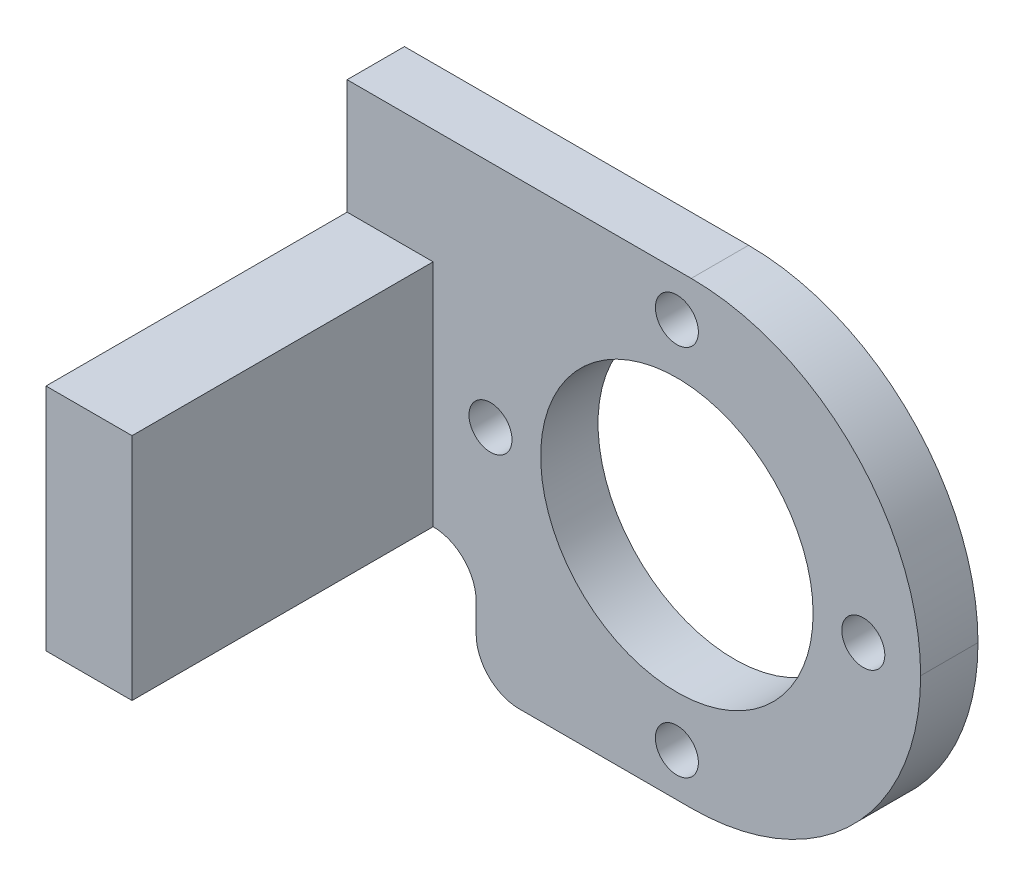
ISO-10303-21;
HEADER;
FILE_DESCRIPTION(('STEP AP214'),'2;1');
FILE_NAME('part.step','',(''),(''),'','','');
FILE_SCHEMA(('AUTOMOTIVE_DESIGN { 1 0 10303 214 1 1 1 1 }'));
ENDSEC;
DATA;
#1=APPLICATION_CONTEXT('core data for automotive mechanical design processes');
#2=APPLICATION_PROTOCOL_DEFINITION('international standard','automotive_design',2000,#1);
#3=PRODUCT_CONTEXT('',#1,'mechanical');
#4=PRODUCT('Part','Part','',(#3));
#5=PRODUCT_RELATED_PRODUCT_CATEGORY('part','',(#4));
#6=PRODUCT_DEFINITION_FORMATION('','',#4);
#7=PRODUCT_DEFINITION_CONTEXT('part definition',#1,'design');
#8=PRODUCT_DEFINITION('design','',#6,#7);
#9=PRODUCT_DEFINITION_SHAPE('','',#8);
#10=(LENGTH_UNIT() NAMED_UNIT(*) SI_UNIT(.MILLI.,.METRE.));
#11=(NAMED_UNIT(*) PLANE_ANGLE_UNIT() SI_UNIT($,.RADIAN.));
#12=(NAMED_UNIT(*) SI_UNIT($,.STERADIAN.) SOLID_ANGLE_UNIT());
#13=UNCERTAINTY_MEASURE_WITH_UNIT(LENGTH_MEASURE(1.E-05),#10,'distance_accuracy_value','');
#14=(GEOMETRIC_REPRESENTATION_CONTEXT(3) GLOBAL_UNCERTAINTY_ASSIGNED_CONTEXT((#13)) GLOBAL_UNIT_ASSIGNED_CONTEXT((#10,
#11,#12)) REPRESENTATION_CONTEXT('',''));
#15=CARTESIAN_POINT('',(0.,0.,0.));
#16=DIRECTION('',(0.,0.,1.));
#17=DIRECTION('',(1.,0.,0.));
#18=AXIS2_PLACEMENT_3D('',#15,#16,#17);
#19=CARTESIAN_POINT('',(-17.,16.,21.));
#20=DIRECTION('',(-1.,0.,0.));
#21=DIRECTION('',(0.,0.,1.));
#22=AXIS2_PLACEMENT_3D('',#19,#20,#21);
#23=PLANE('',#22);
#24=DIRECTION('',(0.,-1.,0.));
#25=VECTOR('',#24,1.);
#26=CARTESIAN_POINT('',(-17.,16.,21.));
#27=LINE('',#26,#25);
#28=CARTESIAN_POINT('',(-17.,8.,21.));
#29=VERTEX_POINT('',#28);
#30=CARTESIAN_POINT('',(-17.,-8.,21.));
#31=VERTEX_POINT('',#30);
#32=EDGE_CURVE('E149',#29,#31,#27,.T.);
#33=ORIENTED_EDGE('',*,*,#32,.T.);
#34=DIRECTION('',(0.,0.,1.));
#35=VECTOR('',#34,1.);
#36=CARTESIAN_POINT('',(-17.,-8.,21.));
#37=LINE('',#36,#35);
#38=CARTESIAN_POINT('',(-17.,-8.,0.));
#39=VERTEX_POINT('',#38);
#40=EDGE_CURVE('E137',#39,#31,#37,.T.);
#41=ORIENTED_EDGE('',*,*,#40,.F.);
#42=DIRECTION('',(0.,-1.,0.));
#43=VECTOR('',#42,1.);
#44=CARTESIAN_POINT('',(-17.,16.,0.));
#45=LINE('',#44,#43);
#46=CARTESIAN_POINT('',(-17.,8.,0.));
#47=VERTEX_POINT('',#46);
#48=EDGE_CURVE('E143',#47,#39,#45,.T.);
#49=ORIENTED_EDGE('',*,*,#48,.F.);
#50=DIRECTION('',(0.,0.,-1.));
#51=VECTOR('',#50,1.);
#52=CARTESIAN_POINT('',(-17.,8.,21.));
#53=LINE('',#52,#51);
#54=EDGE_CURVE('E206',#29,#47,#53,.T.);
#55=ORIENTED_EDGE('',*,*,#54,.F.);
#56=EDGE_LOOP('',(#33,#41,#49,#55));
#57=FACE_BOUND('',#56,.T.);
#58=ADVANCED_FACE('F31',(#57),#23,.F.);
#59=CARTESIAN_POINT('',(-17.,16.,0.));
#60=DIRECTION('',(0.,0.,-1.));
#61=DIRECTION('',(-1.,0.,0.));
#62=AXIS2_PLACEMENT_3D('',#59,#60,#61);
#63=PLANE('',#62);
#64=CARTESIAN_POINT('',(0.,13.,0.));
#65=DIRECTION('',(0.,0.,-1.));
#66=DIRECTION('',(-1.,0.,0.));
#67=AXIS2_PLACEMENT_3D('',#64,#65,#66);
#68=CIRCLE('',#67,1.5);
#69=CARTESIAN_POINT('',(-1.5,13.,0.));
#70=VERTEX_POINT('',#69);
#71=EDGE_CURVE('E453',#70,#70,#68,.T.);
#72=ORIENTED_EDGE('',*,*,#71,.T.);
#73=EDGE_LOOP('',(#72));
#74=FACE_BOUND('',#73,.T.);
#75=CARTESIAN_POINT('',(-13.,0.,0.));
#76=DIRECTION('',(0.,0.,-1.));
#77=DIRECTION('',(-1.,0.,0.));
#78=AXIS2_PLACEMENT_3D('',#75,#76,#77);
#79=CIRCLE('',#78,1.5);
#80=CARTESIAN_POINT('',(-14.5,0.,0.));
#81=VERTEX_POINT('',#80);
#82=EDGE_CURVE('E449',#81,#81,#79,.T.);
#83=ORIENTED_EDGE('',*,*,#82,.T.);
#84=EDGE_LOOP('',(#83));
#85=FACE_BOUND('',#84,.T.);
#86=CARTESIAN_POINT('',(0.,-13.,0.));
#87=DIRECTION('',(0.,0.,-1.));
#88=DIRECTION('',(-1.,0.,0.));
#89=AXIS2_PLACEMENT_3D('',#86,#87,#88);
#90=CIRCLE('',#89,1.5);
#91=CARTESIAN_POINT('',(-1.5,-13.,0.));
#92=VERTEX_POINT('',#91);
#93=EDGE_CURVE('E445',#92,#92,#90,.T.);
#94=ORIENTED_EDGE('',*,*,#93,.T.);
#95=EDGE_LOOP('',(#94));
#96=FACE_BOUND('',#95,.T.);
#97=CARTESIAN_POINT('',(13.,0.,0.));
#98=DIRECTION('',(0.,0.,-1.));
#99=DIRECTION('',(-1.,0.,0.));
#100=AXIS2_PLACEMENT_3D('',#97,#98,#99);
#101=CIRCLE('',#100,1.5);
#102=CARTESIAN_POINT('',(11.5,0.,0.));
#103=VERTEX_POINT('',#102);
#104=EDGE_CURVE('E170',#103,#103,#101,.T.);
#105=ORIENTED_EDGE('',*,*,#104,.T.);
#106=EDGE_LOOP('',(#105));
#107=FACE_BOUND('',#106,.T.);
#108=CARTESIAN_POINT('',(0.,0.,0.));
#109=DIRECTION('',(0.,0.,1.));
#110=DIRECTION('',(1.,0.,0.));
#111=AXIS2_PLACEMENT_3D('',#108,#109,#110);
#112=CIRCLE('',#111,9.5);
#113=CARTESIAN_POINT('',(9.5,0.,0.));
#114=VERTEX_POINT('',#113);
#115=EDGE_CURVE('E169',#114,#114,#112,.T.);
#116=ORIENTED_EDGE('',*,*,#115,.F.);
#117=EDGE_LOOP('',(#116));
#118=FACE_BOUND('',#117,.T.);
#119=DIRECTION('',(0.,1.,0.));
#120=VECTOR('',#119,1.);
#121=CARTESIAN_POINT('',(-14.,-8.,0.));
#122=LINE('',#121,#120);
#123=CARTESIAN_POINT('',(-14.,-13.,0.));
#124=VERTEX_POINT('',#123);
#125=CARTESIAN_POINT('',(-14.,-11.,0.));
#126=VERTEX_POINT('',#125);
#127=EDGE_CURVE('E185',#124,#126,#122,.T.);
#128=ORIENTED_EDGE('',*,*,#127,.F.);
#129=CARTESIAN_POINT('',(-11.,-13.,0.));
#130=DIRECTION('',(0.,0.,-1.));
#131=DIRECTION('',(-1.,0.,0.));
#132=AXIS2_PLACEMENT_3D('',#129,#130,#131);
#133=CIRCLE('',#132,3.);
#134=CARTESIAN_POINT('',(-11.,-16.,0.));
#135=VERTEX_POINT('',#134);
#136=EDGE_CURVE('E175',#124,#135,#133,.F.);
#137=ORIENTED_EDGE('',*,*,#136,.T.);
#138=DIRECTION('',(1.,0.,0.));
#139=VECTOR('',#138,1.);
#140=CARTESIAN_POINT('',(-17.,-16.,0.));
#141=LINE('',#140,#139);
#142=CARTESIAN_POINT('',(1.,-16.,0.));
#143=VERTEX_POINT('',#142);
#144=EDGE_CURVE('E217',#135,#143,#141,.T.);
#145=ORIENTED_EDGE('',*,*,#144,.T.);
#146=CARTESIAN_POINT('',(1.,0.,0.));
#147=DIRECTION('',(0.,0.,-1.));
#148=DIRECTION('',(-1.,0.,0.));
#149=AXIS2_PLACEMENT_3D('',#146,#147,#148);
#150=CIRCLE('',#149,16.);
#151=CARTESIAN_POINT('',(17.,0.,0.));
#152=VERTEX_POINT('',#151);
#153=EDGE_CURVE('E161',#143,#152,#150,.F.);
#154=ORIENTED_EDGE('',*,*,#153,.T.);
#155=CARTESIAN_POINT('',(1.,0.,0.));
#156=DIRECTION('',(0.,0.,-1.));
#157=DIRECTION('',(-1.,0.,0.));
#158=AXIS2_PLACEMENT_3D('',#155,#156,#157);
#159=CIRCLE('',#158,16.);
#160=CARTESIAN_POINT('',(1.,16.,0.));
#161=VERTEX_POINT('',#160);
#162=EDGE_CURVE('E159',#152,#161,#159,.F.);
#163=ORIENTED_EDGE('',*,*,#162,.T.);
#164=DIRECTION('',(1.,0.,0.));
#165=VECTOR('',#164,1.);
#166=CARTESIAN_POINT('',(-17.,16.,0.));
#167=LINE('',#166,#165);
#168=CARTESIAN_POINT('',(-23.,16.,0.));
#169=VERTEX_POINT('',#168);
#170=EDGE_CURVE('E219',#169,#161,#167,.T.);
#171=ORIENTED_EDGE('',*,*,#170,.F.);
#172=DIRECTION('',(0.,1.,0.));
#173=VECTOR('',#172,1.);
#174=CARTESIAN_POINT('',(-23.,16.,0.));
#175=LINE('',#174,#173);
#176=CARTESIAN_POINT('',(-23.,8.,0.));
#177=VERTEX_POINT('',#176);
#178=EDGE_CURVE('E210',#177,#169,#175,.T.);
#179=ORIENTED_EDGE('',*,*,#178,.F.);
#180=DIRECTION('',(1.,0.,0.));
#181=VECTOR('',#180,1.);
#182=CARTESIAN_POINT('',(-23.,8.,0.));
#183=LINE('',#182,#181);
#184=EDGE_CURVE('E215',#177,#47,#183,.T.);
#185=ORIENTED_EDGE('',*,*,#184,.T.);
#186=ORIENTED_EDGE('',*,*,#48,.T.);
#187=CARTESIAN_POINT('',(-17.,-11.,0.));
#188=DIRECTION('',(0.,0.,-1.));
#189=DIRECTION('',(-1.,0.,0.));
#190=AXIS2_PLACEMENT_3D('',#187,#188,#189);
#191=CIRCLE('',#190,3.);
#192=EDGE_CURVE('E39',#39,#126,#191,.T.);
#193=ORIENTED_EDGE('',*,*,#192,.T.);
#194=EDGE_LOOP('',(#128,#137,#145,#154,#163,#171,#179,#185,#186,#193));
#195=FACE_BOUND('',#194,.T.);
#196=ADVANCED_FACE('F184',(#74,#85,#96,#107,#118,#195),#63,.F.);
#197=CARTESIAN_POINT('',(17.,16.,-4.));
#198=DIRECTION('',(0.,0.,1.));
#199=DIRECTION('',(1.,0.,0.));
#200=AXIS2_PLACEMENT_3D('',#197,#198,#199);
#201=PLANE('',#200);
#202=CARTESIAN_POINT('',(0.,13.,-4.));
#203=DIRECTION('',(0.,0.,-1.));
#204=DIRECTION('',(-1.,0.,0.));
#205=AXIS2_PLACEMENT_3D('',#202,#203,#204);
#206=CIRCLE('',#205,1.5);
#207=CARTESIAN_POINT('',(-1.5,13.,-4.));
#208=VERTEX_POINT('',#207);
#209=EDGE_CURVE('E126',#208,#208,#206,.T.);
#210=ORIENTED_EDGE('',*,*,#209,.F.);
#211=EDGE_LOOP('',(#210));
#212=FACE_BOUND('',#211,.T.);
#213=CARTESIAN_POINT('',(-13.,0.,-4.));
#214=DIRECTION('',(0.,0.,-1.));
#215=DIRECTION('',(-1.,0.,0.));
#216=AXIS2_PLACEMENT_3D('',#213,#214,#215);
#217=CIRCLE('',#216,1.5);
#218=CARTESIAN_POINT('',(-14.5,0.,-4.));
#219=VERTEX_POINT('',#218);
#220=EDGE_CURVE('E427',#219,#219,#217,.T.);
#221=ORIENTED_EDGE('',*,*,#220,.F.);
#222=EDGE_LOOP('',(#221));
#223=FACE_BOUND('',#222,.T.);
#224=CARTESIAN_POINT('',(0.,-13.,-4.));
#225=DIRECTION('',(0.,0.,-1.));
#226=DIRECTION('',(-1.,0.,0.));
#227=AXIS2_PLACEMENT_3D('',#224,#225,#226);
#228=CIRCLE('',#227,1.5);
#229=CARTESIAN_POINT('',(-1.5,-13.,-4.));
#230=VERTEX_POINT('',#229);
#231=EDGE_CURVE('E431',#230,#230,#228,.T.);
#232=ORIENTED_EDGE('',*,*,#231,.F.);
#233=EDGE_LOOP('',(#232));
#234=FACE_BOUND('',#233,.T.);
#235=CARTESIAN_POINT('',(13.,0.,-4.));
#236=DIRECTION('',(0.,0.,-1.));
#237=DIRECTION('',(-1.,0.,0.));
#238=AXIS2_PLACEMENT_3D('',#235,#236,#237);
#239=CIRCLE('',#238,1.5);
#240=CARTESIAN_POINT('',(11.5,0.,-4.));
#241=VERTEX_POINT('',#240);
#242=EDGE_CURVE('E435',#241,#241,#239,.T.);
#243=ORIENTED_EDGE('',*,*,#242,.F.);
#244=EDGE_LOOP('',(#243));
#245=FACE_BOUND('',#244,.T.);
#246=CARTESIAN_POINT('',(0.,0.,-4.));
#247=DIRECTION('',(0.,0.,1.));
#248=DIRECTION('',(1.,0.,0.));
#249=AXIS2_PLACEMENT_3D('',#246,#247,#248);
#250=CIRCLE('',#249,9.5);
#251=CARTESIAN_POINT('',(9.5,0.,-4.));
#252=VERTEX_POINT('',#251);
#253=EDGE_CURVE('E199',#252,#252,#250,.T.);
#254=ORIENTED_EDGE('',*,*,#253,.T.);
#255=EDGE_LOOP('',(#254));
#256=FACE_BOUND('',#255,.T.);
#257=DIRECTION('',(-1.,0.,0.));
#258=VECTOR('',#257,1.);
#259=CARTESIAN_POINT('',(17.,-16.,-4.));
#260=LINE('',#259,#258);
#261=CARTESIAN_POINT('',(1.,-16.,-4.));
#262=VERTEX_POINT('',#261);
#263=CARTESIAN_POINT('',(-11.,-16.,-4.));
#264=VERTEX_POINT('',#263);
#265=EDGE_CURVE('E223',#262,#264,#260,.T.);
#266=ORIENTED_EDGE('',*,*,#265,.T.);
#267=CARTESIAN_POINT('',(-11.,-13.,-4.));
#268=DIRECTION('',(0.,0.,1.));
#269=DIRECTION('',(1.,0.,0.));
#270=AXIS2_PLACEMENT_3D('',#267,#268,#269);
#271=CIRCLE('',#270,3.);
#272=CARTESIAN_POINT('',(-14.,-13.,-4.));
#273=VERTEX_POINT('',#272);
#274=EDGE_CURVE('E178',#264,#273,#271,.F.);
#275=ORIENTED_EDGE('',*,*,#274,.T.);
#276=DIRECTION('',(0.,1.,0.));
#277=VECTOR('',#276,1.);
#278=CARTESIAN_POINT('',(-14.,-8.,-4.));
#279=LINE('',#278,#277);
#280=CARTESIAN_POINT('',(-14.,-11.,-4.));
#281=VERTEX_POINT('',#280);
#282=EDGE_CURVE('E127',#273,#281,#279,.T.);
#283=ORIENTED_EDGE('',*,*,#282,.T.);
#284=CARTESIAN_POINT('',(-17.,-11.,-4.));
#285=DIRECTION('',(0.,0.,1.));
#286=DIRECTION('',(1.,0.,0.));
#287=AXIS2_PLACEMENT_3D('',#284,#285,#286);
#288=CIRCLE('',#287,3.);
#289=CARTESIAN_POINT('',(-17.,-8.,-4.));
#290=VERTEX_POINT('',#289);
#291=EDGE_CURVE('E11',#281,#290,#288,.T.);
#292=ORIENTED_EDGE('',*,*,#291,.T.);
#293=DIRECTION('',(-1.,0.,0.));
#294=VECTOR('',#293,1.);
#295=CARTESIAN_POINT('',(-23.,-8.,-4.));
#296=LINE('',#295,#294);
#297=CARTESIAN_POINT('',(-23.,-8.,-4.));
#298=VERTEX_POINT('',#297);
#299=EDGE_CURVE('E116',#290,#298,#296,.T.);
#300=ORIENTED_EDGE('',*,*,#299,.T.);
#301=DIRECTION('',(0.,-1.,0.));
#302=VECTOR('',#301,1.);
#303=CARTESIAN_POINT('',(-23.,16.,-4.));
#304=LINE('',#303,#302);
#305=CARTESIAN_POINT('',(-23.,16.,-4.));
#306=VERTEX_POINT('',#305);
#307=EDGE_CURVE('E121',#306,#298,#304,.T.);
#308=ORIENTED_EDGE('',*,*,#307,.F.);
#309=DIRECTION('',(-1.,0.,0.));
#310=VECTOR('',#309,1.);
#311=CARTESIAN_POINT('',(17.,16.,-4.));
#312=LINE('',#311,#310);
#313=CARTESIAN_POINT('',(1.,16.,-4.));
#314=VERTEX_POINT('',#313);
#315=EDGE_CURVE('E222',#314,#306,#312,.T.);
#316=ORIENTED_EDGE('',*,*,#315,.F.);
#317=CARTESIAN_POINT('',(1.,0.,-4.));
#318=DIRECTION('',(0.,0.,1.));
#319=DIRECTION('',(1.,0.,0.));
#320=AXIS2_PLACEMENT_3D('',#317,#318,#319);
#321=CIRCLE('',#320,16.);
#322=CARTESIAN_POINT('',(17.,0.,-4.));
#323=VERTEX_POINT('',#322);
#324=EDGE_CURVE('E147',#314,#323,#321,.F.);
#325=ORIENTED_EDGE('',*,*,#324,.T.);
#326=CARTESIAN_POINT('',(1.,0.,-4.));
#327=DIRECTION('',(0.,0.,1.));
#328=DIRECTION('',(1.,0.,0.));
#329=AXIS2_PLACEMENT_3D('',#326,#327,#328);
#330=CIRCLE('',#329,16.);
#331=EDGE_CURVE('E154',#323,#262,#330,.F.);
#332=ORIENTED_EDGE('',*,*,#331,.T.);
#333=EDGE_LOOP('',(#266,#275,#283,#292,#300,#308,#316,#325,#332));
#334=FACE_BOUND('',#333,.T.);
#335=ADVANCED_FACE('F118',(#212,#223,#234,#245,#256,#334),#201,.F.);
#336=CARTESIAN_POINT('',(-23.,16.,-4.));
#337=DIRECTION('',(1.,0.,0.));
#338=DIRECTION('',(0.,0.,-1.));
#339=AXIS2_PLACEMENT_3D('',#336,#337,#338);
#340=PLANE('',#339);
#341=ORIENTED_EDGE('',*,*,#307,.T.);
#342=DIRECTION('',(0.,0.,1.));
#343=VECTOR('',#342,1.);
#344=CARTESIAN_POINT('',(-23.,-8.,21.));
#345=LINE('',#344,#343);
#346=CARTESIAN_POINT('',(-23.,-8.,21.));
#347=VERTEX_POINT('',#346);
#348=EDGE_CURVE('E130',#298,#347,#345,.T.);
#349=ORIENTED_EDGE('',*,*,#348,.T.);
#350=DIRECTION('',(0.,-1.,0.));
#351=VECTOR('',#350,1.);
#352=CARTESIAN_POINT('',(-23.,16.,21.));
#353=LINE('',#352,#351);
#354=CARTESIAN_POINT('',(-23.,8.,21.));
#355=VERTEX_POINT('',#354);
#356=EDGE_CURVE('E144',#355,#347,#353,.T.);
#357=ORIENTED_EDGE('',*,*,#356,.F.);
#358=DIRECTION('',(0.,0.,-1.));
#359=VECTOR('',#358,1.);
#360=CARTESIAN_POINT('',(-23.,8.,21.));
#361=LINE('',#360,#359);
#362=EDGE_CURVE('E207',#355,#177,#361,.T.);
#363=ORIENTED_EDGE('',*,*,#362,.T.);
#364=ORIENTED_EDGE('',*,*,#178,.T.);
#365=DIRECTION('',(0.,0.,1.));
#366=VECTOR('',#365,1.);
#367=CARTESIAN_POINT('',(-23.,16.,-4.));
#368=LINE('',#367,#366);
#369=EDGE_CURVE('E142',#306,#169,#368,.T.);
#370=ORIENTED_EDGE('',*,*,#369,.F.);
#371=EDGE_LOOP('',(#341,#349,#357,#363,#364,#370));
#372=FACE_BOUND('',#371,.T.);
#373=ADVANCED_FACE('F139',(#372),#340,.F.);
#374=CARTESIAN_POINT('',(-23.,16.,21.));
#375=DIRECTION('',(0.,0.,-1.));
#376=DIRECTION('',(-1.,0.,0.));
#377=AXIS2_PLACEMENT_3D('',#374,#375,#376);
#378=PLANE('',#377);
#379=ORIENTED_EDGE('',*,*,#356,.T.);
#380=DIRECTION('',(1.,0.,0.));
#381=VECTOR('',#380,1.);
#382=CARTESIAN_POINT('',(-23.,-8.,21.));
#383=LINE('',#382,#381);
#384=EDGE_CURVE('E133',#347,#31,#383,.T.);
#385=ORIENTED_EDGE('',*,*,#384,.T.);
#386=ORIENTED_EDGE('',*,*,#32,.F.);
#387=DIRECTION('',(1.,0.,0.));
#388=VECTOR('',#387,1.);
#389=CARTESIAN_POINT('',(-23.,8.,21.));
#390=LINE('',#389,#388);
#391=EDGE_CURVE('E212',#355,#29,#390,.T.);
#392=ORIENTED_EDGE('',*,*,#391,.F.);
#393=EDGE_LOOP('',(#379,#385,#386,#392));
#394=FACE_BOUND('',#393,.T.);
#395=ADVANCED_FACE('F249',(#394),#378,.F.);
#396=CARTESIAN_POINT('',(-17.,16.,0.));
#397=DIRECTION('',(0.,-1.,0.));
#398=DIRECTION('',(0.,0.,-1.));
#399=AXIS2_PLACEMENT_3D('',#396,#397,#398);
#400=PLANE('',#399);
#401=ORIENTED_EDGE('',*,*,#170,.T.);
#402=DIRECTION('',(0.,0.,-1.));
#403=VECTOR('',#402,1.);
#404=CARTESIAN_POINT('',(1.,16.,0.));
#405=LINE('',#404,#403);
#406=EDGE_CURVE('E163',#161,#314,#405,.T.);
#407=ORIENTED_EDGE('',*,*,#406,.T.);
#408=ORIENTED_EDGE('',*,*,#315,.T.);
#409=ORIENTED_EDGE('',*,*,#369,.T.);
#410=EDGE_LOOP('',(#401,#407,#408,#409));
#411=FACE_BOUND('',#410,.T.);
#412=ADVANCED_FACE('F243',(#411),#400,.F.);
#413=CARTESIAN_POINT('',(-17.,-16.,0.));
#414=DIRECTION('',(0.,-1.,0.));
#415=DIRECTION('',(0.,0.,-1.));
#416=AXIS2_PLACEMENT_3D('',#413,#414,#415);
#417=PLANE('',#416);
#418=ORIENTED_EDGE('',*,*,#144,.F.);
#419=DIRECTION('',(0.,0.,1.));
#420=VECTOR('',#419,1.);
#421=CARTESIAN_POINT('',(-11.,-16.,-4.));
#422=LINE('',#421,#420);
#423=EDGE_CURVE('E52',#135,#264,#422,.F.);
#424=ORIENTED_EDGE('',*,*,#423,.T.);
#425=ORIENTED_EDGE('',*,*,#265,.F.);
#426=DIRECTION('',(0.,0.,-1.));
#427=VECTOR('',#426,1.);
#428=CARTESIAN_POINT('',(1.,-16.,0.));
#429=LINE('',#428,#427);
#430=EDGE_CURVE('E156',#262,#143,#429,.F.);
#431=ORIENTED_EDGE('',*,*,#430,.T.);
#432=EDGE_LOOP('',(#418,#424,#425,#431));
#433=FACE_BOUND('',#432,.T.);
#434=ADVANCED_FACE('F233',(#433),#417,.T.);
#435=CARTESIAN_POINT('',(-23.,8.,21.));
#436=DIRECTION('',(0.,-1.,0.));
#437=DIRECTION('',(0.,0.,-1.));
#438=AXIS2_PLACEMENT_3D('',#435,#436,#437);
#439=PLANE('',#438);
#440=ORIENTED_EDGE('',*,*,#54,.T.);
#441=ORIENTED_EDGE('',*,*,#184,.F.);
#442=ORIENTED_EDGE('',*,*,#362,.F.);
#443=ORIENTED_EDGE('',*,*,#391,.T.);
#444=EDGE_LOOP('',(#440,#441,#442,#443));
#445=FACE_BOUND('',#444,.T.);
#446=ADVANCED_FACE('F247',(#445),#439,.F.);
#447=CARTESIAN_POINT('',(-23.,-8.,21.));
#448=DIRECTION('',(0.,1.,0.));
#449=DIRECTION('',(0.,0.,1.));
#450=AXIS2_PLACEMENT_3D('',#447,#448,#449);
#451=PLANE('',#450);
#452=ORIENTED_EDGE('',*,*,#299,.F.);
#453=DIRECTION('',(0.,0.,1.));
#454=VECTOR('',#453,1.);
#455=CARTESIAN_POINT('',(-17.,-8.,0.));
#456=LINE('',#455,#454);
#457=EDGE_CURVE('E180',#290,#39,#456,.T.);
#458=ORIENTED_EDGE('',*,*,#457,.T.);
#459=ORIENTED_EDGE('',*,*,#40,.T.);
#460=ORIENTED_EDGE('',*,*,#384,.F.);
#461=ORIENTED_EDGE('',*,*,#348,.F.);
#462=EDGE_LOOP('',(#452,#458,#459,#460,#461));
#463=FACE_BOUND('',#462,.T.);
#464=ADVANCED_FACE('F131',(#463),#451,.F.);
#465=CARTESIAN_POINT('',(0.,0.,-4.));
#466=DIRECTION('',(0.,0.,1.));
#467=DIRECTION('',(1.,0.,0.));
#468=AXIS2_PLACEMENT_3D('',#465,#466,#467);
#469=CYLINDRICAL_SURFACE('',#468,9.5);
#470=ORIENTED_EDGE('',*,*,#253,.F.);
#471=EDGE_LOOP('',(#470));
#472=FACE_BOUND('',#471,.T.);
#473=ORIENTED_EDGE('',*,*,#115,.T.);
#474=EDGE_LOOP('',(#473));
#475=FACE_BOUND('',#474,.T.);
#476=ADVANCED_FACE('F274',(#472,#475),#469,.F.);
#477=CARTESIAN_POINT('',(1.,0.,0.));
#478=DIRECTION('',(0.,0.,-1.));
#479=DIRECTION('',(-1.,0.,0.));
#480=AXIS2_PLACEMENT_3D('',#477,#478,#479);
#481=CYLINDRICAL_SURFACE('',#480,16.);
#482=ORIENTED_EDGE('',*,*,#406,.F.);
#483=ORIENTED_EDGE('',*,*,#162,.F.);
#484=DIRECTION('',(0.,0.,-1.));
#485=VECTOR('',#484,1.);
#486=CARTESIAN_POINT('',(17.,0.,0.));
#487=LINE('',#486,#485);
#488=EDGE_CURVE('E166',#323,#152,#487,.F.);
#489=ORIENTED_EDGE('',*,*,#488,.F.);
#490=ORIENTED_EDGE('',*,*,#324,.F.);
#491=EDGE_LOOP('',(#482,#483,#489,#490));
#492=FACE_BOUND('',#491,.T.);
#493=ADVANCED_FACE('F240',(#492),#481,.T.);
#494=CARTESIAN_POINT('',(1.,0.,0.));
#495=DIRECTION('',(0.,0.,1.));
#496=DIRECTION('',(1.,0.,0.));
#497=AXIS2_PLACEMENT_3D('',#494,#495,#496);
#498=CYLINDRICAL_SURFACE('',#497,16.);
#499=ORIENTED_EDGE('',*,*,#153,.F.);
#500=ORIENTED_EDGE('',*,*,#430,.F.);
#501=ORIENTED_EDGE('',*,*,#331,.F.);
#502=ORIENTED_EDGE('',*,*,#488,.T.);
#503=EDGE_LOOP('',(#499,#500,#501,#502));
#504=FACE_BOUND('',#503,.T.);
#505=ADVANCED_FACE('F235',(#504),#498,.T.);
#506=CARTESIAN_POINT('',(13.,0.,-4.));
#507=DIRECTION('',(0.,0.,-1.));
#508=DIRECTION('',(-1.,0.,0.));
#509=AXIS2_PLACEMENT_3D('',#506,#507,#508);
#510=CYLINDRICAL_SURFACE('',#509,1.5);
#511=ORIENTED_EDGE('',*,*,#242,.T.);
#512=EDGE_LOOP('',(#511));
#513=FACE_BOUND('',#512,.T.);
#514=ORIENTED_EDGE('',*,*,#104,.F.);
#515=EDGE_LOOP('',(#514));
#516=FACE_BOUND('',#515,.T.);
#517=ADVANCED_FACE('F272',(#513,#516),#510,.F.);
#518=CARTESIAN_POINT('',(0.,-13.,-4.));
#519=DIRECTION('',(0.,0.,-1.));
#520=DIRECTION('',(-1.,0.,0.));
#521=AXIS2_PLACEMENT_3D('',#518,#519,#520);
#522=CYLINDRICAL_SURFACE('',#521,1.5);
#523=ORIENTED_EDGE('',*,*,#231,.T.);
#524=EDGE_LOOP('',(#523));
#525=FACE_BOUND('',#524,.T.);
#526=ORIENTED_EDGE('',*,*,#93,.F.);
#527=EDGE_LOOP('',(#526));
#528=FACE_BOUND('',#527,.T.);
#529=ADVANCED_FACE('F291',(#525,#528),#522,.F.);
#530=CARTESIAN_POINT('',(-13.,0.,-4.));
#531=DIRECTION('',(0.,0.,-1.));
#532=DIRECTION('',(-1.,0.,0.));
#533=AXIS2_PLACEMENT_3D('',#530,#531,#532);
#534=CYLINDRICAL_SURFACE('',#533,1.5);
#535=ORIENTED_EDGE('',*,*,#220,.T.);
#536=EDGE_LOOP('',(#535));
#537=FACE_BOUND('',#536,.T.);
#538=ORIENTED_EDGE('',*,*,#82,.F.);
#539=EDGE_LOOP('',(#538));
#540=FACE_BOUND('',#539,.T.);
#541=ADVANCED_FACE('F285',(#537,#540),#534,.F.);
#542=CARTESIAN_POINT('',(0.,13.,-4.));
#543=DIRECTION('',(0.,0.,-1.));
#544=DIRECTION('',(-1.,0.,0.));
#545=AXIS2_PLACEMENT_3D('',#542,#543,#544);
#546=CYLINDRICAL_SURFACE('',#545,1.5);
#547=ORIENTED_EDGE('',*,*,#209,.T.);
#548=EDGE_LOOP('',(#547));
#549=FACE_BOUND('',#548,.T.);
#550=ORIENTED_EDGE('',*,*,#71,.F.);
#551=EDGE_LOOP('',(#550));
#552=FACE_BOUND('',#551,.T.);
#553=ADVANCED_FACE('F280',(#549,#552),#546,.F.);
#554=CARTESIAN_POINT('',(-14.,-8.,-4.));
#555=DIRECTION('',(1.,0.,0.));
#556=DIRECTION('',(0.,1.,0.));
#557=AXIS2_PLACEMENT_3D('',#554,#555,#556);
#558=PLANE('',#557);
#559=ORIENTED_EDGE('',*,*,#282,.F.);
#560=DIRECTION('',(0.,0.,1.));
#561=VECTOR('',#560,1.);
#562=CARTESIAN_POINT('',(-14.,-13.,0.));
#563=LINE('',#562,#561);
#564=EDGE_CURVE('E172',#273,#124,#563,.T.);
#565=ORIENTED_EDGE('',*,*,#564,.T.);
#566=ORIENTED_EDGE('',*,*,#127,.T.);
#567=DIRECTION('',(0.,0.,1.));
#568=VECTOR('',#567,1.);
#569=CARTESIAN_POINT('',(-14.,-11.,-4.));
#570=LINE('',#569,#568);
#571=EDGE_CURVE('E165',#126,#281,#570,.F.);
#572=ORIENTED_EDGE('',*,*,#571,.T.);
#573=EDGE_LOOP('',(#559,#565,#566,#572));
#574=FACE_BOUND('',#573,.T.);
#575=ADVANCED_FACE('F191',(#574),#558,.F.);
#576=CARTESIAN_POINT('',(-11.,-13.,-4.));
#577=DIRECTION('',(0.,0.,-1.));
#578=DIRECTION('',(-1.,0.,0.));
#579=AXIS2_PLACEMENT_3D('',#576,#577,#578);
#580=CYLINDRICAL_SURFACE('',#579,3.);
#581=ORIENTED_EDGE('',*,*,#274,.F.);
#582=ORIENTED_EDGE('',*,*,#423,.F.);
#583=ORIENTED_EDGE('',*,*,#136,.F.);
#584=ORIENTED_EDGE('',*,*,#564,.F.);
#585=EDGE_LOOP('',(#581,#582,#583,#584));
#586=FACE_BOUND('',#585,.T.);
#587=ADVANCED_FACE('F231',(#586),#580,.T.);
#588=CARTESIAN_POINT('',(-17.,-11.,21.));
#589=DIRECTION('',(0.,0.,-1.));
#590=DIRECTION('',(-1.,0.,0.));
#591=AXIS2_PLACEMENT_3D('',#588,#589,#590);
#592=CYLINDRICAL_SURFACE('',#591,3.);
#593=ORIENTED_EDGE('',*,*,#291,.F.);
#594=ORIENTED_EDGE('',*,*,#571,.F.);
#595=ORIENTED_EDGE('',*,*,#192,.F.);
#596=ORIENTED_EDGE('',*,*,#457,.F.);
#597=EDGE_LOOP('',(#593,#594,#595,#596));
#598=FACE_BOUND('',#597,.T.);
#599=ADVANCED_FACE('F33',(#598),#592,.F.);
#600=CLOSED_SHELL('',(#58,#196,#335,#373,#395,#412,#434,#446,#464,#476,#493,#505,#517,#529,#541,
#553,#575,#587,#599));
#601=MANIFOLD_SOLID_BREP('B2',#600);
#602=ADVANCED_BREP_SHAPE_REPRESENTATION('',(#18,#601),#14);
#603=SHAPE_DEFINITION_REPRESENTATION(#9,#602);
ENDSEC;
END-ISO-10303-21;
